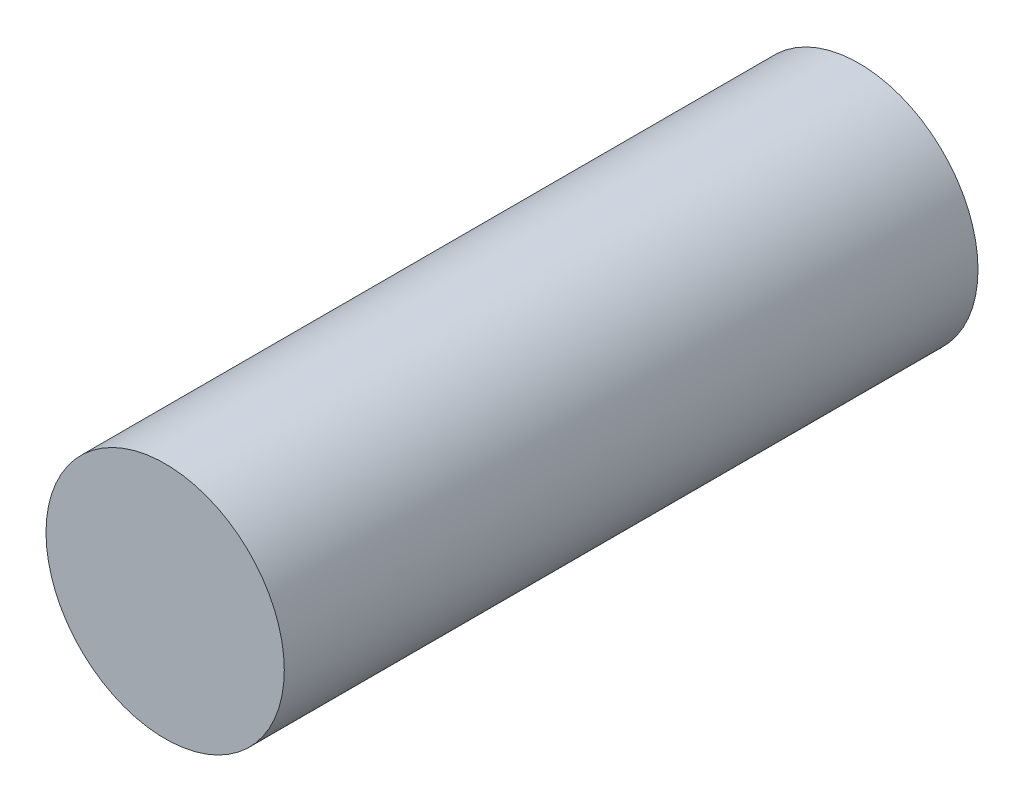
ISO-10303-21;
HEADER;
FILE_DESCRIPTION(('STEP AP214'),'2;1');
FILE_NAME('part.step','',(''),(''),'','','');
FILE_SCHEMA(('AUTOMOTIVE_DESIGN { 1 0 10303 214 1 1 1 1 }'));
ENDSEC;
DATA;
#1=APPLICATION_CONTEXT('core data for automotive mechanical design processes');
#2=APPLICATION_PROTOCOL_DEFINITION('international standard','automotive_design',2000,#1);
#3=PRODUCT_CONTEXT('',#1,'mechanical');
#4=PRODUCT('Part','Part','',(#3));
#5=PRODUCT_RELATED_PRODUCT_CATEGORY('part','',(#4));
#6=PRODUCT_DEFINITION_FORMATION('','',#4);
#7=PRODUCT_DEFINITION_CONTEXT('part definition',#1,'design');
#8=PRODUCT_DEFINITION('design','',#6,#7);
#9=PRODUCT_DEFINITION_SHAPE('','',#8);
#10=(LENGTH_UNIT() NAMED_UNIT(*) SI_UNIT(.MILLI.,.METRE.));
#11=(NAMED_UNIT(*) PLANE_ANGLE_UNIT() SI_UNIT($,.RADIAN.));
#12=(NAMED_UNIT(*) SI_UNIT($,.STERADIAN.) SOLID_ANGLE_UNIT());
#13=UNCERTAINTY_MEASURE_WITH_UNIT(LENGTH_MEASURE(1.E-05),#10,'distance_accuracy_value','');
#14=(GEOMETRIC_REPRESENTATION_CONTEXT(3) GLOBAL_UNCERTAINTY_ASSIGNED_CONTEXT((#13)) GLOBAL_UNIT_ASSIGNED_CONTEXT((#10,
#11,#12)) REPRESENTATION_CONTEXT('',''));
#15=CARTESIAN_POINT('',(0.,0.,0.));
#16=DIRECTION('',(0.,0.,1.));
#17=DIRECTION('',(1.,0.,0.));
#18=AXIS2_PLACEMENT_3D('',#15,#16,#17);
#19=CARTESIAN_POINT('',(108.042890629012,14.6364798694711,-37.7390133317052));
#20=DIRECTION('',(0.,0.,1.));
#21=DIRECTION('',(1.,0.,0.));
#22=AXIS2_PLACEMENT_3D('',#19,#20,#21);
#23=CYLINDRICAL_SURFACE('',#22,4.36249999999999);
#24=CARTESIAN_POINT('',(108.042890629012,14.6364798694711,-25.4));
#25=DIRECTION('',(0.,0.,1.));
#26=DIRECTION('',(1.,0.,0.));
#27=AXIS2_PLACEMENT_3D('',#24,#25,#26);
#28=CIRCLE('',#27,4.36249999999999);
#29=CARTESIAN_POINT('',(112.405390629012,14.6364798694711,-25.4));
#30=VERTEX_POINT('',#29);
#31=EDGE_CURVE('E12',#30,#30,#28,.F.);
#32=ORIENTED_EDGE('',*,*,#31,.F.);
#33=EDGE_LOOP('',(#32));
#34=FACE_BOUND('',#33,.T.);
#35=CARTESIAN_POINT('',(108.042890629012,14.6364798694711,0.));
#36=DIRECTION('',(0.,0.,1.));
#37=DIRECTION('',(1.,0.,0.));
#38=AXIS2_PLACEMENT_3D('',#35,#36,#37);
#39=CIRCLE('',#38,4.36249999999999);
#40=CARTESIAN_POINT('',(112.405390629012,14.6364798694711,0.));
#41=VERTEX_POINT('',#40);
#42=EDGE_CURVE('E47',#41,#41,#39,.T.);
#43=ORIENTED_EDGE('',*,*,#42,.F.);
#44=EDGE_LOOP('',(#43));
#45=FACE_BOUND('',#44,.T.);
#46=ADVANCED_FACE('F41',(#34,#45),#23,.T.);
#47=CARTESIAN_POINT('',(108.042890629012,14.6364798694711,0.));
#48=DIRECTION('',(0.,0.,1.));
#49=DIRECTION('',(1.,0.,0.));
#50=AXIS2_PLACEMENT_3D('',#47,#48,#49);
#51=PLANE('',#50);
#52=ORIENTED_EDGE('',*,*,#42,.T.);
#53=EDGE_LOOP('',(#52));
#54=FACE_BOUND('',#53,.T.);
#55=ADVANCED_FACE('F53',(#54),#51,.T.);
#56=CARTESIAN_POINT('',(108.042890629012,14.6364798694711,-25.4));
#57=DIRECTION('',(0.,0.,1.));
#58=DIRECTION('',(1.,0.,0.));
#59=AXIS2_PLACEMENT_3D('',#56,#57,#58);
#60=PLANE('',#59);
#61=ORIENTED_EDGE('',*,*,#31,.T.);
#62=EDGE_LOOP('',(#61));
#63=FACE_BOUND('',#62,.T.);
#64=ADVANCED_FACE('F60',(#63),#60,.F.);
#65=CLOSED_SHELL('',(#46,#55,#64));
#66=MANIFOLD_SOLID_BREP('B2',#65);
#67=ADVANCED_BREP_SHAPE_REPRESENTATION('',(#18,#66),#14);
#68=SHAPE_DEFINITION_REPRESENTATION(#9,#67);
ENDSEC;
END-ISO-10303-21;
